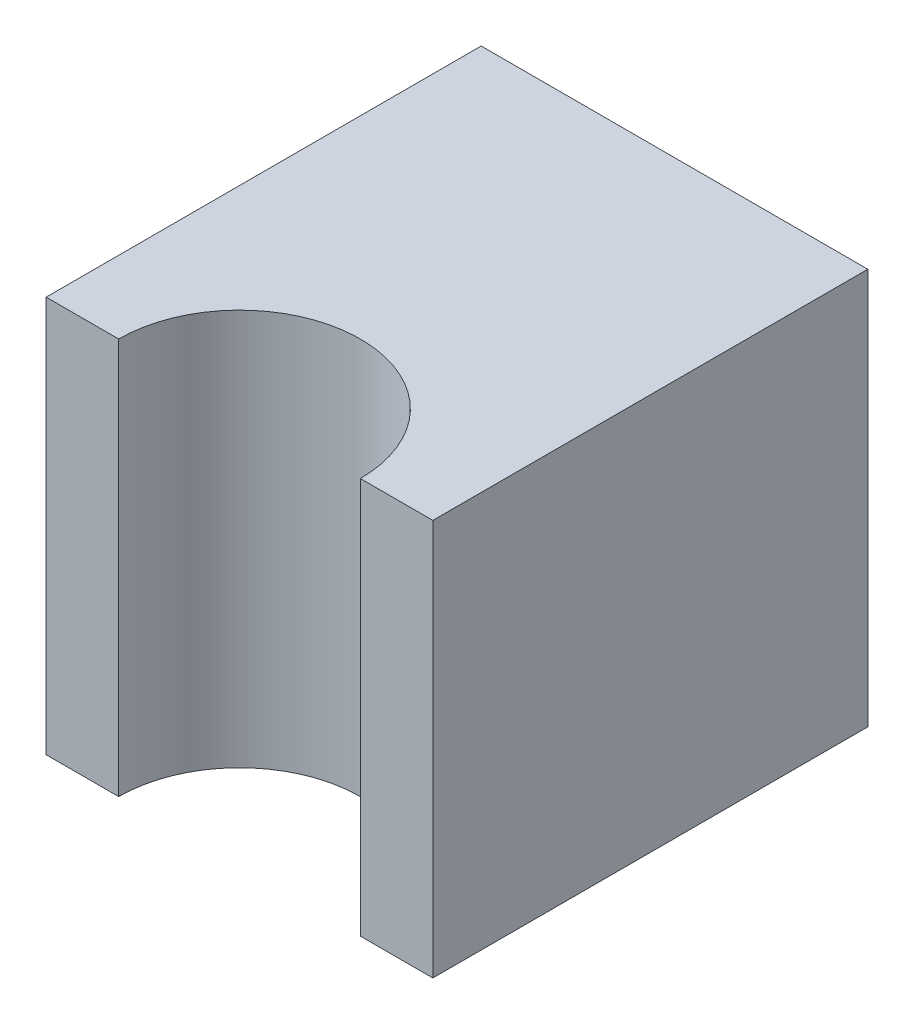
ISO-10303-21;
HEADER;
FILE_DESCRIPTION(('STEP AP214'),'2;1');
FILE_NAME('part.step','',(''),(''),'','','');
FILE_SCHEMA(('AUTOMOTIVE_DESIGN { 1 0 10303 214 1 1 1 1 }'));
ENDSEC;
DATA;
#1=APPLICATION_CONTEXT('core data for automotive mechanical design processes');
#2=APPLICATION_PROTOCOL_DEFINITION('international standard','automotive_design',2000,#1);
#3=PRODUCT_CONTEXT('',#1,'mechanical');
#4=PRODUCT('Part','Part','',(#3));
#5=PRODUCT_RELATED_PRODUCT_CATEGORY('part','',(#4));
#6=PRODUCT_DEFINITION_FORMATION('','',#4);
#7=PRODUCT_DEFINITION_CONTEXT('part definition',#1,'design');
#8=PRODUCT_DEFINITION('design','',#6,#7);
#9=PRODUCT_DEFINITION_SHAPE('','',#8);
#10=(LENGTH_UNIT() NAMED_UNIT(*) SI_UNIT(.MILLI.,.METRE.));
#11=(NAMED_UNIT(*) PLANE_ANGLE_UNIT() SI_UNIT($,.RADIAN.));
#12=(NAMED_UNIT(*) SI_UNIT($,.STERADIAN.) SOLID_ANGLE_UNIT());
#13=UNCERTAINTY_MEASURE_WITH_UNIT(LENGTH_MEASURE(1.E-05),#10,'distance_accuracy_value','');
#14=(GEOMETRIC_REPRESENTATION_CONTEXT(3) GLOBAL_UNCERTAINTY_ASSIGNED_CONTEXT((#13)) GLOBAL_UNIT_ASSIGNED_CONTEXT((#10,
#11,#12)) REPRESENTATION_CONTEXT('',''));
#15=CARTESIAN_POINT('',(0.,0.,0.));
#16=DIRECTION('',(0.,0.,1.));
#17=DIRECTION('',(1.,0.,0.));
#18=AXIS2_PLACEMENT_3D('',#15,#16,#17);
#19=CARTESIAN_POINT('',(6.15,0.,6.1));
#20=DIRECTION('',(0.,0.,1.));
#21=DIRECTION('',(1.,0.,0.));
#22=AXIS2_PLACEMENT_3D('',#19,#20,#21);
#23=PLANE('',#22);
#24=DIRECTION('',(1.,0.,0.));
#25=VECTOR('',#24,1.);
#26=CARTESIAN_POINT('',(5.9,0.82,6.1));
#27=LINE('',#26,#25);
#28=CARTESIAN_POINT('',(6.15,0.82,6.1));
#29=VERTEX_POINT('',#28);
#30=CARTESIAN_POINT('',(6.3,0.82,6.1));
#31=VERTEX_POINT('',#30);
#32=EDGE_CURVE('E76',#29,#31,#27,.T.);
#33=ORIENTED_EDGE('',*,*,#32,.F.);
#34=DIRECTION('',(0.,1.,0.));
#35=VECTOR('',#34,1.);
#36=CARTESIAN_POINT('',(6.15,0.,6.1));
#37=LINE('',#36,#35);
#38=CARTESIAN_POINT('',(6.15,0.,6.1));
#39=VERTEX_POINT('',#38);
#40=EDGE_CURVE('E72',#29,#39,#37,.F.);
#41=ORIENTED_EDGE('',*,*,#40,.T.);
#42=DIRECTION('',(1.,0.,0.));
#43=VECTOR('',#42,1.);
#44=CARTESIAN_POINT('',(5.9,0.,6.1));
#45=LINE('',#44,#43);
#46=CARTESIAN_POINT('',(6.3,0.,6.1));
#47=VERTEX_POINT('',#46);
#48=EDGE_CURVE('E73',#39,#47,#45,.T.);
#49=ORIENTED_EDGE('',*,*,#48,.T.);
#50=DIRECTION('',(0.,1.,0.));
#51=VECTOR('',#50,1.);
#52=CARTESIAN_POINT('',(6.3,0.,6.1));
#53=LINE('',#52,#51);
#54=EDGE_CURVE('E80',#31,#47,#53,.F.);
#55=ORIENTED_EDGE('',*,*,#54,.F.);
#56=EDGE_LOOP('',(#33,#41,#49,#55));
#57=FACE_BOUND('',#56,.T.);
#58=ADVANCED_FACE('F17',(#57),#23,.T.);
#59=CARTESIAN_POINT('',(5.9,0.,6.1));
#60=DIRECTION('',(0.,1.,0.));
#61=DIRECTION('',(0.,0.,1.));
#62=AXIS2_PLACEMENT_3D('',#59,#60,#61);
#63=CYLINDRICAL_SURFACE('',#62,0.25);
#64=ORIENTED_EDGE('',*,*,#40,.F.);
#65=CARTESIAN_POINT('',(5.9,0.82,6.1));
#66=DIRECTION('',(0.,1.,0.));
#67=DIRECTION('',(0.,0.,1.));
#68=AXIS2_PLACEMENT_3D('',#65,#66,#67);
#69=CIRCLE('',#68,0.25);
#70=CARTESIAN_POINT('',(5.65,0.82,6.1));
#71=VERTEX_POINT('',#70);
#72=EDGE_CURVE('E129',#71,#29,#69,.F.);
#73=ORIENTED_EDGE('',*,*,#72,.F.);
#74=DIRECTION('',(0.,1.,0.));
#75=VECTOR('',#74,1.);
#76=CARTESIAN_POINT('',(5.65,0.,6.1));
#77=LINE('',#76,#75);
#78=CARTESIAN_POINT('',(5.65,0.,6.1));
#79=VERTEX_POINT('',#78);
#80=EDGE_CURVE('E83',#79,#71,#77,.T.);
#81=ORIENTED_EDGE('',*,*,#80,.F.);
#82=CARTESIAN_POINT('',(5.9,0.,6.1));
#83=DIRECTION('',(0.,1.,0.));
#84=DIRECTION('',(0.,0.,1.));
#85=AXIS2_PLACEMENT_3D('',#82,#83,#84);
#86=CIRCLE('',#85,0.25);
#87=EDGE_CURVE('E20',#79,#39,#86,.F.);
#88=ORIENTED_EDGE('',*,*,#87,.T.);
#89=EDGE_LOOP('',(#64,#73,#81,#88));
#90=FACE_BOUND('',#89,.T.);
#91=ADVANCED_FACE('F82',(#90),#63,.F.);
#92=CARTESIAN_POINT('',(6.3,0.,6.1));
#93=DIRECTION('',(1.,0.,0.));
#94=DIRECTION('',(0.,0.,-1.));
#95=AXIS2_PLACEMENT_3D('',#92,#93,#94);
#96=PLANE('',#95);
#97=DIRECTION('',(0.,0.,1.));
#98=VECTOR('',#97,1.);
#99=CARTESIAN_POINT('',(6.3,0.82,5.65));
#100=LINE('',#99,#98);
#101=CARTESIAN_POINT('',(6.3,0.82,5.2));
#102=VERTEX_POINT('',#101);
#103=EDGE_CURVE('E108',#31,#102,#100,.F.);
#104=ORIENTED_EDGE('',*,*,#103,.F.);
#105=ORIENTED_EDGE('',*,*,#54,.T.);
#106=DIRECTION('',(0.,0.,1.));
#107=VECTOR('',#106,1.);
#108=CARTESIAN_POINT('',(6.3,0.,5.65));
#109=LINE('',#108,#107);
#110=CARTESIAN_POINT('',(6.3,0.,5.2));
#111=VERTEX_POINT('',#110);
#112=EDGE_CURVE('E85',#47,#111,#109,.F.);
#113=ORIENTED_EDGE('',*,*,#112,.T.);
#114=DIRECTION('',(0.,1.,0.));
#115=VECTOR('',#114,1.);
#116=CARTESIAN_POINT('',(6.3,0.,5.2));
#117=LINE('',#116,#115);
#118=EDGE_CURVE('E120',#102,#111,#117,.F.);
#119=ORIENTED_EDGE('',*,*,#118,.F.);
#120=EDGE_LOOP('',(#104,#105,#113,#119));
#121=FACE_BOUND('',#120,.T.);
#122=ADVANCED_FACE('F144',(#121),#96,.T.);
#123=CARTESIAN_POINT('',(5.9,0.,5.65));
#124=DIRECTION('',(0.,1.,0.));
#125=DIRECTION('',(0.,0.,1.));
#126=AXIS2_PLACEMENT_3D('',#123,#124,#125);
#127=PLANE('',#126);
#128=ORIENTED_EDGE('',*,*,#87,.F.);
#129=DIRECTION('',(1.,0.,0.));
#130=VECTOR('',#129,1.);
#131=CARTESIAN_POINT('',(5.5,0.,6.1));
#132=LINE('',#131,#130);
#133=CARTESIAN_POINT('',(5.5,0.,6.1));
#134=VERTEX_POINT('',#133);
#135=EDGE_CURVE('E88',#134,#79,#132,.T.);
#136=ORIENTED_EDGE('',*,*,#135,.F.);
#137=DIRECTION('',(0.,0.,1.));
#138=VECTOR('',#137,1.);
#139=CARTESIAN_POINT('',(5.5,0.,5.2));
#140=LINE('',#139,#138);
#141=CARTESIAN_POINT('',(5.5,0.,5.2));
#142=VERTEX_POINT('',#141);
#143=EDGE_CURVE('E105',#142,#134,#140,.T.);
#144=ORIENTED_EDGE('',*,*,#143,.F.);
#145=DIRECTION('',(-1.,0.,0.));
#146=VECTOR('',#145,1.);
#147=CARTESIAN_POINT('',(6.3,0.,5.2));
#148=LINE('',#147,#146);
#149=EDGE_CURVE('E126',#111,#142,#148,.T.);
#150=ORIENTED_EDGE('',*,*,#149,.F.);
#151=ORIENTED_EDGE('',*,*,#112,.F.);
#152=ORIENTED_EDGE('',*,*,#48,.F.);
#153=EDGE_LOOP('',(#128,#136,#144,#150,#151,#152));
#154=FACE_BOUND('',#153,.T.);
#155=ADVANCED_FACE('F86',(#154),#127,.F.);
#156=CARTESIAN_POINT('',(5.5,0.,6.1));
#157=DIRECTION('',(0.,0.,1.));
#158=DIRECTION('',(1.,0.,0.));
#159=AXIS2_PLACEMENT_3D('',#156,#157,#158);
#160=PLANE('',#159);
#161=DIRECTION('',(1.,0.,0.));
#162=VECTOR('',#161,1.);
#163=CARTESIAN_POINT('',(5.9,0.82,6.1));
#164=LINE('',#163,#162);
#165=CARTESIAN_POINT('',(5.5,0.82,6.1));
#166=VERTEX_POINT('',#165);
#167=EDGE_CURVE('E110',#166,#71,#164,.T.);
#168=ORIENTED_EDGE('',*,*,#167,.F.);
#169=DIRECTION('',(0.,1.,0.));
#170=VECTOR('',#169,1.);
#171=CARTESIAN_POINT('',(5.5,0.,6.1));
#172=LINE('',#171,#170);
#173=EDGE_CURVE('E100',#134,#166,#172,.T.);
#174=ORIENTED_EDGE('',*,*,#173,.F.);
#175=ORIENTED_EDGE('',*,*,#135,.T.);
#176=ORIENTED_EDGE('',*,*,#80,.T.);
#177=EDGE_LOOP('',(#168,#174,#175,#176));
#178=FACE_BOUND('',#177,.T.);
#179=ADVANCED_FACE('F151',(#178),#160,.T.);
#180=CARTESIAN_POINT('',(5.9,0.82,5.65));
#181=DIRECTION('',(0.,1.,0.));
#182=DIRECTION('',(0.,0.,1.));
#183=AXIS2_PLACEMENT_3D('',#180,#181,#182);
#184=PLANE('',#183);
#185=ORIENTED_EDGE('',*,*,#167,.T.);
#186=ORIENTED_EDGE('',*,*,#72,.T.);
#187=ORIENTED_EDGE('',*,*,#32,.T.);
#188=ORIENTED_EDGE('',*,*,#103,.T.);
#189=DIRECTION('',(-1.,0.,0.));
#190=VECTOR('',#189,1.);
#191=CARTESIAN_POINT('',(6.3,0.82,5.2));
#192=LINE('',#191,#190);
#193=CARTESIAN_POINT('',(5.5,0.82,5.2));
#194=VERTEX_POINT('',#193);
#195=EDGE_CURVE('E35',#194,#102,#192,.F.);
#196=ORIENTED_EDGE('',*,*,#195,.F.);
#197=DIRECTION('',(0.,0.,1.));
#198=VECTOR('',#197,1.);
#199=CARTESIAN_POINT('',(5.5,0.82,5.2));
#200=LINE('',#199,#198);
#201=EDGE_CURVE('E26',#166,#194,#200,.F.);
#202=ORIENTED_EDGE('',*,*,#201,.F.);
#203=EDGE_LOOP('',(#185,#186,#187,#188,#196,#202));
#204=FACE_BOUND('',#203,.T.);
#205=ADVANCED_FACE('F140',(#204),#184,.T.);
#206=CARTESIAN_POINT('',(6.3,0.,5.2));
#207=DIRECTION('',(0.,0.,-1.));
#208=DIRECTION('',(-1.,0.,0.));
#209=AXIS2_PLACEMENT_3D('',#206,#207,#208);
#210=PLANE('',#209);
#211=ORIENTED_EDGE('',*,*,#195,.T.);
#212=ORIENTED_EDGE('',*,*,#118,.T.);
#213=ORIENTED_EDGE('',*,*,#149,.T.);
#214=DIRECTION('',(0.,1.,0.));
#215=VECTOR('',#214,1.);
#216=CARTESIAN_POINT('',(5.5,0.,5.2));
#217=LINE('',#216,#215);
#218=EDGE_CURVE('E11',#194,#142,#217,.F.);
#219=ORIENTED_EDGE('',*,*,#218,.F.);
#220=EDGE_LOOP('',(#211,#212,#213,#219));
#221=FACE_BOUND('',#220,.T.);
#222=ADVANCED_FACE('F146',(#221),#210,.T.);
#223=CARTESIAN_POINT('',(5.5,0.,5.2));
#224=DIRECTION('',(-1.,0.,0.));
#225=DIRECTION('',(0.,0.,1.));
#226=AXIS2_PLACEMENT_3D('',#223,#224,#225);
#227=PLANE('',#226);
#228=ORIENTED_EDGE('',*,*,#201,.T.);
#229=ORIENTED_EDGE('',*,*,#218,.T.);
#230=ORIENTED_EDGE('',*,*,#143,.T.);
#231=ORIENTED_EDGE('',*,*,#173,.T.);
#232=EDGE_LOOP('',(#228,#229,#230,#231));
#233=FACE_BOUND('',#232,.T.);
#234=ADVANCED_FACE('F148',(#233),#227,.T.);
#235=CLOSED_SHELL('',(#58,#91,#122,#155,#179,#205,#222,#234));
#236=MANIFOLD_SOLID_BREP('B1',#235);
#237=ADVANCED_BREP_SHAPE_REPRESENTATION('',(#18,#236),#14);
#238=SHAPE_DEFINITION_REPRESENTATION(#9,#237);
ENDSEC;
END-ISO-10303-21;
